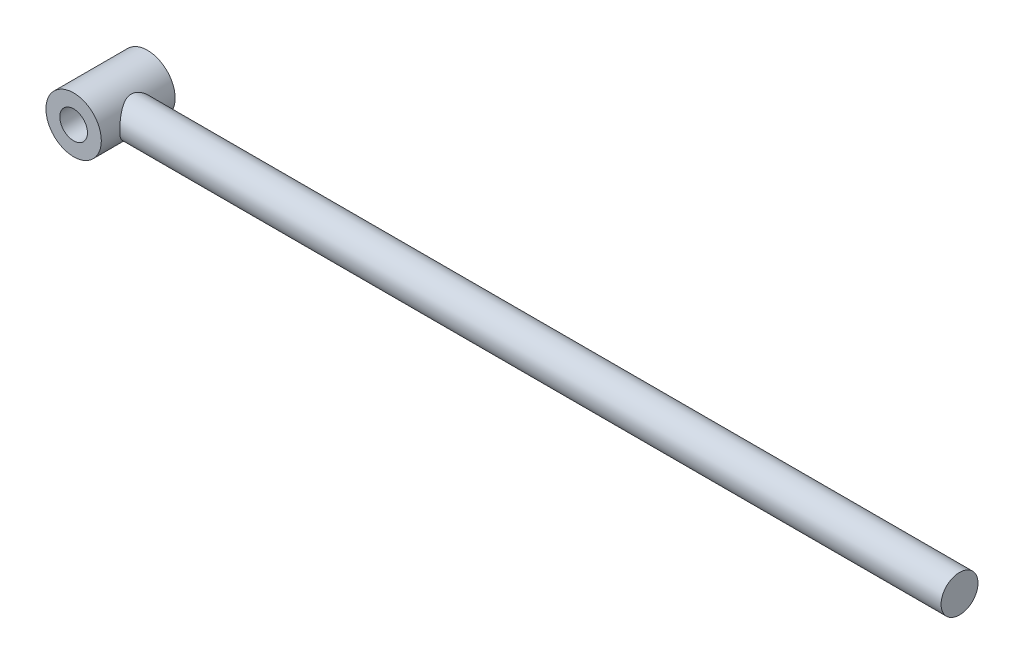
ISO-10303-21;
HEADER;
FILE_DESCRIPTION(('STEP AP214'),'2;1');
FILE_NAME('part.step','',(''),(''),'','','');
FILE_SCHEMA(('AUTOMOTIVE_DESIGN { 1 0 10303 214 1 1 1 1 }'));
ENDSEC;
DATA;
#1=APPLICATION_CONTEXT('core data for automotive mechanical design processes');
#2=APPLICATION_PROTOCOL_DEFINITION('international standard','automotive_design',2000,#1);
#3=PRODUCT_CONTEXT('',#1,'mechanical');
#4=PRODUCT('Part','Part','',(#3));
#5=PRODUCT_RELATED_PRODUCT_CATEGORY('part','',(#4));
#6=PRODUCT_DEFINITION_FORMATION('','',#4);
#7=PRODUCT_DEFINITION_CONTEXT('part definition',#1,'design');
#8=PRODUCT_DEFINITION('design','',#6,#7);
#9=PRODUCT_DEFINITION_SHAPE('','',#8);
#10=(LENGTH_UNIT() NAMED_UNIT(*) SI_UNIT(.MILLI.,.METRE.));
#11=(NAMED_UNIT(*) PLANE_ANGLE_UNIT() SI_UNIT($,.RADIAN.));
#12=(NAMED_UNIT(*) SI_UNIT($,.STERADIAN.) SOLID_ANGLE_UNIT());
#13=UNCERTAINTY_MEASURE_WITH_UNIT(LENGTH_MEASURE(1.E-05),#10,'distance_accuracy_value','');
#14=(GEOMETRIC_REPRESENTATION_CONTEXT(3) GLOBAL_UNCERTAINTY_ASSIGNED_CONTEXT((#13)) GLOBAL_UNIT_ASSIGNED_CONTEXT((#10,
#11,#12)) REPRESENTATION_CONTEXT('',''));
#15=CARTESIAN_POINT('',(0.,0.,0.));
#16=DIRECTION('',(0.,0.,1.));
#17=DIRECTION('',(1.,0.,0.));
#18=AXIS2_PLACEMENT_3D('',#15,#16,#17);
#19=CARTESIAN_POINT('',(0.,0.,40.));
#20=DIRECTION('',(0.,0.,-1.));
#21=DIRECTION('',(-1.,0.,0.));
#22=AXIS2_PLACEMENT_3D('',#19,#20,#21);
#23=CYLINDRICAL_SURFACE('',#22,30.);
#24=CARTESIAN_POINT('',(0.,0.,40.));
#25=DIRECTION('',(0.,0.,1.));
#26=DIRECTION('',(1.,0.,0.));
#27=AXIS2_PLACEMENT_3D('',#24,#25,#26);
#28=CIRCLE('',#27,30.);
#29=CARTESIAN_POINT('',(30.,0.,40.));
#30=VERTEX_POINT('',#29);
#31=EDGE_CURVE('E42',#30,#30,#28,.T.);
#32=ORIENTED_EDGE('',*,*,#31,.F.);
#33=EDGE_LOOP('',(#32));
#34=FACE_BOUND('',#33,.T.);
#35=CARTESIAN_POINT('',(0.,0.,-40.));
#36=DIRECTION('',(0.,0.,1.));
#37=DIRECTION('',(1.,0.,0.));
#38=AXIS2_PLACEMENT_3D('',#35,#36,#37);
#39=CIRCLE('',#38,30.);
#40=CARTESIAN_POINT('',(30.,0.,-40.));
#41=VERTEX_POINT('',#40);
#42=EDGE_CURVE('E46',#41,#41,#39,.T.);
#43=ORIENTED_EDGE('',*,*,#42,.T.);
#44=EDGE_LOOP('',(#43));
#45=FACE_BOUND('',#44,.T.);
#46=CARTESIAN_POINT('',(30.,0.,20.));
#47=CARTESIAN_POINT('',(29.9999998661981,-0.502432050357107,19.9999998708156));
#48=CARTESIAN_POINT('',(29.9873512767924,-1.00486659291617,19.981041890221));
#49=CARTESIAN_POINT('',(29.9370754507124,-2.00562861223446,19.9055087079442));
#50=CARTESIAN_POINT('',(29.8994480825663,-2.50395606736271,19.8489333082686));
#51=CARTESIAN_POINT('',(29.8001252135495,-3.49278874290095,19.6990002879968));
#52=CARTESIAN_POINT('',(29.7384203306489,-3.98329083644028,19.6056283291341));
#53=CARTESIAN_POINT('',(29.5924098661005,-4.9527367018995,19.3834395211629));
#54=CARTESIAN_POINT('',(29.5081040111715,-5.43168033398314,19.2546222434644));
#55=CARTESIAN_POINT('',(29.3192451350848,-6.3726831529905,18.9639204802124));
#56=CARTESIAN_POINT('',(29.2147907649452,-6.83481207132658,18.8021969068242));
#57=CARTESIAN_POINT('',(28.987567335659,-7.74207070686117,18.4471586375469));
#58=CARTESIAN_POINT('',(28.864798371266,-8.18720051199242,18.2538441050984));
#59=CARTESIAN_POINT('',(28.6033482003015,-9.05844037609498,17.8375381124749));
#60=CARTESIAN_POINT('',(28.4646675126729,-9.48455105472426,17.6145476201097));
#61=CARTESIAN_POINT('',(28.1739113247129,-10.3162415378409,17.1407197895657));
#62=CARTESIAN_POINT('',(28.0218342454824,-10.7218189133778,16.88987916806));
#63=CARTESIAN_POINT('',(27.6935578417576,-11.544666651525,16.3397046695659));
#64=CARTESIAN_POINT('',(27.5164065024113,-11.9600134544702,16.0380625153589));
#65=CARTESIAN_POINT('',(27.1528656210948,-12.7638755092378,15.4060039283267));
#66=CARTESIAN_POINT('',(26.9664756598522,-13.1523895414017,15.0755861890756));
#67=CARTESIAN_POINT('',(26.5877396332004,-13.9021114634373,14.3871695519229));
#68=CARTESIAN_POINT('',(26.3953859507486,-14.2632822184454,14.0291344326562));
#69=CARTESIAN_POINT('',(26.0086530551827,-14.9568597365416,13.2872215493219));
#70=CARTESIAN_POINT('',(25.8142737230126,-15.2892647981446,12.9033422589614));
#71=CARTESIAN_POINT('',(25.396836648899,-15.9745417178036,12.0482275933553));
#72=CARTESIAN_POINT('',(25.174096536266,-16.3223586443349,11.5727693191127));
#73=CARTESIAN_POINT('',(24.7376939344548,-16.9764877633748,10.5899657994356));
#74=CARTESIAN_POINT('',(24.5240335140448,-17.2827905315006,10.0826133516483));
#75=CARTESIAN_POINT('',(24.1134541975624,-17.8511644026812,9.03819236671138));
#76=CARTESIAN_POINT('',(23.9165127661255,-18.1132955295477,8.50116549380746));
#77=CARTESIAN_POINT('',(23.5472211433069,-18.5908454263022,7.39870988362545));
#78=CARTESIAN_POINT('',(23.3748591544978,-18.8062866319954,6.83329494920044));
#79=CARTESIAN_POINT('',(23.1083554699939,-19.13202887715,5.84404921175392));
#80=CARTESIAN_POINT('',(23.0059988256492,-19.254726201792,5.42648017350507));
#81=CARTESIAN_POINT('',(22.8211903176783,-19.4734126020971,4.58008091505703));
#82=CARTESIAN_POINT('',(22.7387352052499,-19.5694060373963,4.15125254556424));
#83=CARTESIAN_POINT('',(22.5966842761104,-19.7332623242764,3.28516192271634));
#84=CARTESIAN_POINT('',(22.5370547106277,-19.8011667190628,2.84791313270976));
#85=CARTESIAN_POINT('',(22.442775186748,-19.9079619855319,1.96717747103349));
#86=CARTESIAN_POINT('',(22.4081253652476,-19.9468526982109,1.5236905651906));
#87=CARTESIAN_POINT('',(22.3651578047493,-19.995018995311,0.631973802665962));
#88=CARTESIAN_POINT('',(22.3569497015249,-20.0041712760879,0.183731910267435));
#89=CARTESIAN_POINT('',(22.3675301691013,-19.9923398271623,-0.712030658740458));
#90=CARTESIAN_POINT('',(22.3863188316053,-19.971355995093,-1.15955133289481));
#91=CARTESIAN_POINT('',(22.4501086857203,-19.8996205096492,-2.050625095392));
#92=CARTESIAN_POINT('',(22.4951293541334,-19.8488467375743,-2.49417498677212));
#93=CARTESIAN_POINT('',(22.6095581655225,-19.7184018881212,-3.37377492739303));
#94=CARTESIAN_POINT('',(22.6789667736164,-19.6387302596127,-3.80982483343045));
#95=CARTESIAN_POINT('',(22.8360020403641,-19.4558684710411,-4.65260599507371));
#96=CARTESIAN_POINT('',(22.9226794986437,-19.3538839737256,-5.05977803330656));
#97=CARTESIAN_POINT('',(23.1133089528256,-19.1258219416928,-5.86323587316174));
#98=CARTESIAN_POINT('',(23.2172676308142,-18.9997350845369,-6.25951739443491));
#99=CARTESIAN_POINT('',(23.5509005263236,-18.5870898788947,-7.42993067111853));
#100=CARTESIAN_POINT('',(23.8024209013306,-18.2660472919538,-8.18608179416508));
#101=CARTESIAN_POINT('',(24.2342569329526,-17.6854431992285,-9.35228726673066));
#102=CARTESIAN_POINT('',(24.403077317783,-17.4522559964646,-9.78032481496439));
#103=CARTESIAN_POINT('',(24.7497432705651,-16.9570483876589,-10.6157476442302));
#104=CARTESIAN_POINT('',(24.9275896995493,-16.6950252280375,-11.023130947529));
#105=CARTESIAN_POINT('',(25.2885468949722,-16.1430567151301,-11.8167546644321));
#106=CARTESIAN_POINT('',(25.471663237886,-15.8530809594392,-12.2029713238621));
#107=CARTESIAN_POINT('',(25.8393965051977,-15.246358714758,-12.9530389311317));
#108=CARTESIAN_POINT('',(26.024013528533,-14.9296104475491,-13.3168883905748));
#109=CARTESIAN_POINT('',(26.4310497738324,-14.1989483888887,-14.097303197129));
#110=CARTESIAN_POINT('',(26.6530303956695,-13.7788159652825,-14.5083033678111));
#111=CARTESIAN_POINT('',(27.0885965336176,-12.9014676729698,-15.2937513429522));
#112=CARTESIAN_POINT('',(27.3021805000215,-12.4442450060576,-15.6681924187186));
#113=CARTESIAN_POINT('',(27.7153401348638,-11.4946861176089,-16.3775183221479));
#114=CARTESIAN_POINT('',(27.9149260225621,-11.0023760522687,-16.7124321311584));
#115=CARTESIAN_POINT('',(28.2949676279155,-9.98447354240779,-17.3397652164747));
#116=CARTESIAN_POINT('',(28.4754286055529,-9.45889031296221,-17.6321961852127));
#117=CARTESIAN_POINT('',(28.7791644068812,-8.4833461227497,-18.1181905483136));
#118=CARTESIAN_POINT('',(28.9067147978732,-8.03875717640116,-18.3198975753372));
#119=CARTESIAN_POINT('',(29.1437173052015,-7.13185034835575,-18.691623162803));
#120=CARTESIAN_POINT('',(29.2531715370476,-6.66953454679109,-18.8616454276103));
#121=CARTESIAN_POINT('',(29.4516277514227,-5.7299227277189,-19.1679937956703));
#122=CARTESIAN_POINT('',(29.5406434674396,-5.25263701566193,-19.3043425302522));
#123=CARTESIAN_POINT('',(29.6963305492252,-4.28575432400347,-19.5417523912564));
#124=CARTESIAN_POINT('',(29.7630015712691,-3.79615715514135,-19.6428129748477));
#125=CARTESIAN_POINT('',(29.872657894971,-2.80597314349125,-19.8085733139663));
#126=CARTESIAN_POINT('',(29.9155383206477,-2.30534759903096,-19.8731120951364));
#127=CARTESIAN_POINT('',(29.9760956021539,-1.29911991465958,-19.9641545523483));
#128=CARTESIAN_POINT('',(29.9937724250504,-0.793517768246534,-19.9906581786905));
#129=CARTESIAN_POINT('',(30.0034717951189,0.218464736427053,-20.0052080328604));
#130=CARTESIAN_POINT('',(29.9954953996663,0.724845061752678,-19.9932558457617));
#131=CARTESIAN_POINT('',(29.9540933231667,1.73418156784465,-19.931087455494));
#132=CARTESIAN_POINT('',(29.9206687283027,2.23713789383013,-19.8808728854445));
#133=CARTESIAN_POINT('',(29.8324414506934,3.20042176411033,-19.7478312691314));
#134=CARTESIAN_POINT('',(29.7793090042603,3.66125811656818,-19.6675483452082));
#135=CARTESIAN_POINT('',(29.6529106481444,4.57350157570509,-19.4756341111471));
#136=CARTESIAN_POINT('',(29.5796458717002,5.02490921158323,-19.3640045654864));
#137=CARTESIAN_POINT('',(29.4144446665676,5.91571607198156,-19.1106977521881));
#138=CARTESIAN_POINT('',(29.3225070223762,6.35511451265425,-18.9690185284518));
#139=CARTESIAN_POINT('',(29.1217004947068,7.21966385402625,-18.6571079304231));
#140=CARTESIAN_POINT('',(29.0128307093883,7.64481399436505,-18.486875035266));
#141=CARTESIAN_POINT('',(28.7730488442419,8.50426678457443,-18.1083152340667));
#142=CARTESIAN_POINT('',(28.641201691667,8.93756698372232,-17.8983067263232));
#143=CARTESIAN_POINT('',(28.3631030211141,9.78432512725706,-17.449829798643));
#144=CARTESIAN_POINT('',(28.2168510697156,10.1977824740429,-17.2113605223154));
#145=CARTESIAN_POINT('',(27.9124418593605,11.0036909497809,-16.7076242018634));
#146=CARTESIAN_POINT('',(27.7542793038351,11.3961325988641,-16.4423452174859));
#147=CARTESIAN_POINT('',(27.4287361682711,12.1587990167243,-15.8866695617355));
#148=CARTESIAN_POINT('',(27.2613545613898,12.5290213010131,-15.5962700903114));
#149=CARTESIAN_POINT('',(26.8930879740092,13.3031347178692,-14.9439528947196));
#150=CARTESIAN_POINT('',(26.6910905163229,13.7030923841241,-14.5779874749765));
#151=CARTESIAN_POINT('',(26.2826982946006,14.4709683638239,-13.8160664974289));
#152=CARTESIAN_POINT('',(26.0763029510259,14.8388824217615,-13.4201069693141));
#153=CARTESIAN_POINT('',(25.6635739697582,15.5417880165119,-12.5994023240134));
#154=CARTESIAN_POINT('',(25.4572404691787,15.876757023597,-12.174637839138));
#155=CARTESIAN_POINT('',(25.0497261492331,16.5122275702686,-11.2977646153286));
#156=CARTESIAN_POINT('',(24.8485448051984,16.81273263041,-10.8456586765927));
#157=CARTESIAN_POINT('',(24.4733023029991,17.3538627139578,-9.95448274755281));
#158=CARTESIAN_POINT('',(24.2983863656877,17.5974024349064,-9.51754297050518));
#159=CARTESIAN_POINT('',(23.9619407246742,18.0528546349536,-8.62244520074572));
#160=CARTESIAN_POINT('',(23.8004112149102,18.2647666558762,-8.16428690077693));
#161=CARTESIAN_POINT('',(23.4959190621918,18.6548371117046,-7.22866142786252));
#162=CARTESIAN_POINT('',(23.352929353255,18.8330449293941,-6.75122376801286));
#163=CARTESIAN_POINT('',(23.0904591353035,19.1539484457238,-5.77827480129949));
#164=CARTESIAN_POINT('',(22.9709732247938,19.2966523056608,-5.28276767814733));
#165=CARTESIAN_POINT('',(22.7795445121487,19.5220414226083,-4.36698264384053));
#166=CARTESIAN_POINT('',(22.7029160837044,19.6109049179647,-3.94920001271946));
#167=CARTESIAN_POINT('',(22.5714513943609,19.7620762933325,-3.1054686934564));
#168=CARTESIAN_POINT('',(22.5166125085731,19.82438737206,-2.6795209954077));
#169=CARTESIAN_POINT('',(22.4307802243878,19.9214537495162,-1.8224911908299));
#170=CARTESIAN_POINT('',(22.3997648547817,19.9562344390175,-1.39141418836717));
#171=CARTESIAN_POINT('',(22.3627151772862,19.9977438544737,-0.526818989046352));
#172=CARTESIAN_POINT('',(22.3566812339737,20.0044721710347,-0.093300756653625));
#173=CARTESIAN_POINT('',(22.3698449862022,19.9897505651309,0.773115287328889));
#174=CARTESIAN_POINT('',(22.3890570855061,19.9682845568072,1.20601260355544));
#175=CARTESIAN_POINT('',(22.4519644396444,19.89752521375,2.06770261584204));
#176=CARTESIAN_POINT('',(22.4956594937704,19.8482321071399,2.49649534552171));
#177=CARTESIAN_POINT('',(22.6059284972836,19.7225495457303,3.34758196945676));
#178=CARTESIAN_POINT('',(22.672528474229,19.6461292623078,3.76986789699179));
#179=CARTESIAN_POINT('',(22.8262602119977,19.4672984586528,4.60508117377623));
#180=CARTESIAN_POINT('',(22.9133946099072,19.3648846001243,5.01800731354381));
#181=CARTESIAN_POINT('',(23.1310818906606,19.1046848410163,5.94123169432083));
#182=CARTESIAN_POINT('',(23.2670175183132,18.9394160062732,6.44816076864198));
#183=CARTESIAN_POINT('',(23.5616278122302,18.5716220555323,7.44147650640459));
#184=CARTESIAN_POINT('',(23.7203087439171,18.3690866697139,7.92785746170607));
#185=CARTESIAN_POINT('',(24.0548494900776,17.928768029319,8.87885978411792));
#186=CARTESIAN_POINT('',(24.230727597647,17.6909470983741,9.34345718517344));
#187=CARTESIAN_POINT('',(24.5941802563021,17.1820850766219,10.2491849776676));
#188=CARTESIAN_POINT('',(24.781754189423,16.9110457402246,10.6903166066737));
#189=CARTESIAN_POINT('',(25.1672255632098,16.3319905343255,11.5560455039427));
#190=CARTESIAN_POINT('',(25.3652486390898,16.0233924051234,11.9801968484712));
#191=CARTESIAN_POINT('',(25.7637225763061,15.3745104302451,12.8022908705141));
#192=CARTESIAN_POINT('',(25.9641734317233,15.0342266618099,13.200233611914));
#193=CARTESIAN_POINT('',(26.3632502502894,14.3228973596636,13.9688530344093));
#194=CARTESIAN_POINT('',(26.5618756733661,13.951843028237,14.33952185996));
#195=CARTESIAN_POINT('',(26.9531887772778,13.180017889376,15.0520096270216));
#196=CARTESIAN_POINT('',(27.1458759630328,12.779244613665,15.3938261671826));
#197=CARTESIAN_POINT('',(27.5484327444244,11.8892953412499,16.0937728405199));
#198=CARTESIAN_POINT('',(27.7567878541469,11.3956949938791,16.4471788212645));
#199=CARTESIAN_POINT('',(28.1549839321458,10.372947033489,17.1106254017982));
#200=CARTESIAN_POINT('',(28.3448221999976,9.84379425458726,17.42065967928));
#201=CARTESIAN_POINT('',(28.7002669540513,8.7534583378163,17.9932104380746));
#202=CARTESIAN_POINT('',(28.8659031307225,8.19231563994947,18.2557852367735));
#203=CARTESIAN_POINT('',(29.1680076078479,7.04137086874954,18.7298173077689));
#204=CARTESIAN_POINT('',(29.3044861493112,6.45157894748342,18.9412925311521));
#205=CARTESIAN_POINT('',(29.5171038312658,5.38222751658728,19.2683981125324));
#206=CARTESIAN_POINT('',(29.5999120726272,4.90728446450014,19.3948839484347));
#207=CARTESIAN_POINT('',(29.7432935523992,3.94618639128292,19.6130133782002));
#208=CARTESIAN_POINT('',(29.8038703786017,3.46003319276103,19.7046625942176));
#209=CARTESIAN_POINT('',(29.9013488891663,2.48023551916962,19.8517933612465));
#210=CARTESIAN_POINT('',(29.9382651667603,1.98659585428405,19.9072972061548));
#211=CARTESIAN_POINT('',(29.9875912480541,0.995305041117371,19.9814012816267));
#212=CARTESIAN_POINT('',(30.0000001325294,0.497653743070644,20.0000001279558));
#213=CARTESIAN_POINT('',(30.,0.,20.));
#214=B_SPLINE_CURVE_WITH_KNOTS('',3,(#46,#47,#48,#49,#50,#51,#52,#53,#54,#55,#56,#57,#58,#59,
#60,#61,#62,#63,#64,#65,#66,#67,#68,#69,#70,#71,#72,#73,#74,#75,#76,#77,#78,#79,#80,#81,#82,#83,
#84,#85,#86,#87,#88,#89,#90,#91,#92,#93,#94,#95,#96,#97,#98,#99,#100,#101,#102,#103,#104,#105,
#106,#107,#108,#109,#110,#111,#112,#113,#114,#115,#116,#117,#118,#119,#120,#121,#122,#123,#124,
#125,#126,#127,#128,#129,#130,#131,#132,#133,#134,#135,#136,#137,#138,#139,#140,#141,#142,#143,
#144,#145,#146,#147,#148,#149,#150,#151,#152,#153,#154,#155,#156,#157,#158,#159,#160,#161,#162,
#163,#164,#165,#166,#167,#168,#169,#170,#171,#172,#173,#174,#175,#176,#177,#178,#179,#180,#181,
#182,#183,#184,#185,#186,#187,#188,#189,#190,#191,#192,#193,#194,#195,#196,#197,#198,#199,#200,
#201,#202,#203,#204,#205,#206,#207,#208,#209,#210,#211,#212,#213),.UNSPECIFIED.,.T.,.F.,(4,2,2,
2,2,2,2,2,2,2,2,2,2,2,2,2,2,2,2,2,2,2,2,2,2,2,2,2,2,2,2,2,2,2,2,2,2,2,2,2,2,2,2,2,2,2,2,2,2,2,2,
2,2,2,2,2,2,2,2,2,2,2,2,2,2,2,2,2,2,2,2,2,2,2,2,2,2,2,2,2,2,2,2,4),(0.,1.50678860030269,
3.01358513141216,4.52096938721657,6.02837187047945,7.52857302893605,9.02876642612416,
10.5289109101103,12.0292324383504,13.6567444840869,15.284330458243,16.9140886133164,
18.5439431024577,20.431131930561,22.3187484658921,24.2037789087041,26.0879015235946,
27.4279650999174,28.7678097709498,30.1056656880386,31.4435289369311,32.7869323000986,
34.1303402265693,35.4747468830929,36.8191791810432,38.1037263431644,39.3887713582513,
41.9574635192448,43.5039572638651,45.0505988133526,46.5989419535985,48.1473880150574,
50.0299431140749,51.9128440463346,53.7943557465543,55.6753486185392,57.1876211138398,
58.6997166935429,60.2107932404063,61.7218930308516,63.2396023156496,64.7573135836025,
66.2749622952646,67.7925462340977,69.2033177886316,70.6140099478306,72.0247939649324,
73.4356531490233,74.9318700392892,76.4281319624119,77.9250632379934,79.4221615843148,
81.1559974776003,82.8900632805819,84.6253068106235,86.3603729242013,87.9487273830719,
89.5371048494666,91.1231367124568,92.7088036566569,94.0093258243475,95.3096912764256,
96.6088560233589,97.9080397301251,99.2079649891922,100.507879591774,101.809276234171,
103.110840096639,104.759184673476,106.407984179069,108.058557042328,109.70904276911,
111.389510486189,113.069974106853,114.750919862111,116.432005383304,118.354868197109,
120.278011015838,122.198774401875,124.118862046836,125.61242765333,127.105752116314,
128.598154645697,130.090613151129),.UNSPECIFIED.);
#215=CARTESIAN_POINT('',(30.,0.,20.));
#216=VERTEX_POINT('',#215);
#217=EDGE_CURVE('E10',#216,#216,#214,.T.);
#218=ORIENTED_EDGE('',*,*,#217,.F.);
#219=EDGE_LOOP('',(#218));
#220=FACE_BOUND('',#219,.T.);
#221=ADVANCED_FACE('F31',(#34,#45,#220),#23,.T.);
#222=CARTESIAN_POINT('',(0.,0.,40.));
#223=DIRECTION('',(0.,0.,1.));
#224=DIRECTION('',(1.,0.,0.));
#225=AXIS2_PLACEMENT_3D('',#222,#223,#224);
#226=PLANE('',#225);
#227=ORIENTED_EDGE('',*,*,#31,.T.);
#228=EDGE_LOOP('',(#227));
#229=FACE_BOUND('',#228,.T.);
#230=CARTESIAN_POINT('',(0.,0.,40.));
#231=DIRECTION('',(0.,0.,1.));
#232=DIRECTION('',(1.,0.,0.));
#233=AXIS2_PLACEMENT_3D('',#230,#231,#232);
#234=CIRCLE('',#233,15.);
#235=CARTESIAN_POINT('',(15.,0.,40.));
#236=VERTEX_POINT('',#235);
#237=EDGE_CURVE('E51',#236,#236,#234,.T.);
#238=ORIENTED_EDGE('',*,*,#237,.F.);
#239=EDGE_LOOP('',(#238));
#240=FACE_BOUND('',#239,.T.);
#241=ADVANCED_FACE('F77',(#229,#240),#226,.T.);
#242=CARTESIAN_POINT('',(0.,0.,-40.));
#243=DIRECTION('',(0.,0.,1.));
#244=DIRECTION('',(1.,0.,0.));
#245=AXIS2_PLACEMENT_3D('',#242,#243,#244);
#246=PLANE('',#245);
#247=ORIENTED_EDGE('',*,*,#42,.F.);
#248=EDGE_LOOP('',(#247));
#249=FACE_BOUND('',#248,.T.);
#250=CARTESIAN_POINT('',(0.,0.,-40.));
#251=DIRECTION('',(0.,0.,1.));
#252=DIRECTION('',(1.,0.,0.));
#253=AXIS2_PLACEMENT_3D('',#250,#251,#252);
#254=CIRCLE('',#253,15.);
#255=CARTESIAN_POINT('',(15.,0.,-40.));
#256=VERTEX_POINT('',#255);
#257=EDGE_CURVE('E53',#256,#256,#254,.T.);
#258=ORIENTED_EDGE('',*,*,#257,.T.);
#259=EDGE_LOOP('',(#258));
#260=FACE_BOUND('',#259,.T.);
#261=ADVANCED_FACE('F72',(#249,#260),#246,.F.);
#262=CARTESIAN_POINT('',(0.,0.,40.));
#263=DIRECTION('',(0.,0.,-1.));
#264=DIRECTION('',(-1.,0.,0.));
#265=AXIS2_PLACEMENT_3D('',#262,#263,#264);
#266=CYLINDRICAL_SURFACE('',#265,15.);
#267=ORIENTED_EDGE('',*,*,#237,.T.);
#268=EDGE_LOOP('',(#267));
#269=FACE_BOUND('',#268,.T.);
#270=ORIENTED_EDGE('',*,*,#257,.F.);
#271=EDGE_LOOP('',(#270));
#272=FACE_BOUND('',#271,.T.);
#273=ADVANCED_FACE('F66',(#269,#272),#266,.F.);
#274=CARTESIAN_POINT('',(920.,0.,0.));
#275=DIRECTION('',(-1.,0.,0.));
#276=DIRECTION('',(0.,0.,1.));
#277=AXIS2_PLACEMENT_3D('',#274,#275,#276);
#278=CYLINDRICAL_SURFACE('',#277,20.);
#279=CARTESIAN_POINT('',(920.,0.,0.));
#280=DIRECTION('',(1.,0.,0.));
#281=DIRECTION('',(0.,0.,-1.));
#282=AXIS2_PLACEMENT_3D('',#279,#280,#281);
#283=CIRCLE('',#282,20.);
#284=CARTESIAN_POINT('',(920.,0.,-20.));
#285=VERTEX_POINT('',#284);
#286=EDGE_CURVE('E56',#285,#285,#283,.T.);
#287=ORIENTED_EDGE('',*,*,#286,.F.);
#288=EDGE_LOOP('',(#287));
#289=FACE_BOUND('',#288,.T.);
#290=ORIENTED_EDGE('',*,*,#217,.T.);
#291=EDGE_LOOP('',(#290));
#292=FACE_BOUND('',#291,.T.);
#293=ADVANCED_FACE('F64',(#289,#292),#278,.T.);
#294=CARTESIAN_POINT('',(920.,0.,0.));
#295=DIRECTION('',(1.,0.,0.));
#296=DIRECTION('',(0.,0.,-1.));
#297=AXIS2_PLACEMENT_3D('',#294,#295,#296);
#298=PLANE('',#297);
#299=ORIENTED_EDGE('',*,*,#286,.T.);
#300=EDGE_LOOP('',(#299));
#301=FACE_BOUND('',#300,.T.);
#302=ADVANCED_FACE('F62',(#301),#298,.T.);
#303=CLOSED_SHELL('',(#221,#241,#261,#273,#293,#302));
#304=MANIFOLD_SOLID_BREP('B2',#303);
#305=ADVANCED_BREP_SHAPE_REPRESENTATION('',(#18,#304),#14);
#306=SHAPE_DEFINITION_REPRESENTATION(#9,#305);
ENDSEC;
END-ISO-10303-21;
